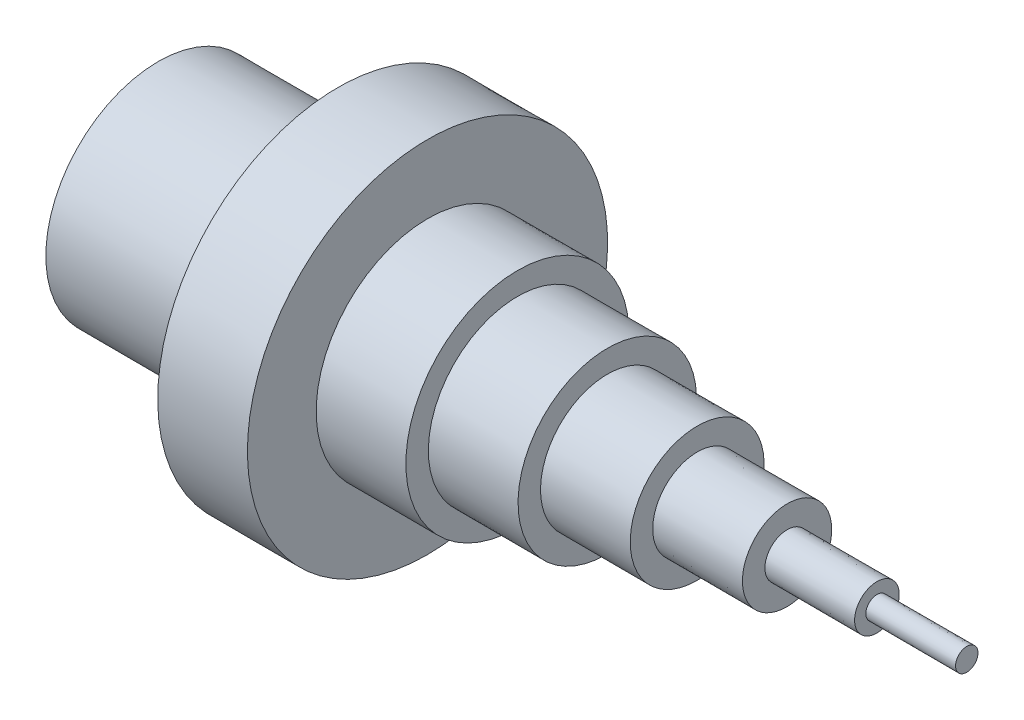
ISO-10303-21;
HEADER;
FILE_DESCRIPTION(('STEP AP214'),'2;1');
FILE_NAME('part.step','',(''),(''),'','','');
FILE_SCHEMA(('AUTOMOTIVE_DESIGN { 1 0 10303 214 1 1 1 1 }'));
ENDSEC;
DATA;
#1=APPLICATION_CONTEXT('core data for automotive mechanical design processes');
#2=APPLICATION_PROTOCOL_DEFINITION('international standard','automotive_design',2000,#1);
#3=PRODUCT_CONTEXT('',#1,'mechanical');
#4=PRODUCT('Part','Part','',(#3));
#5=PRODUCT_RELATED_PRODUCT_CATEGORY('part','',(#4));
#6=PRODUCT_DEFINITION_FORMATION('','',#4);
#7=PRODUCT_DEFINITION_CONTEXT('part definition',#1,'design');
#8=PRODUCT_DEFINITION('design','',#6,#7);
#9=PRODUCT_DEFINITION_SHAPE('','',#8);
#10=(LENGTH_UNIT() NAMED_UNIT(*) SI_UNIT(.MILLI.,.METRE.));
#11=(NAMED_UNIT(*) PLANE_ANGLE_UNIT() SI_UNIT($,.RADIAN.));
#12=(NAMED_UNIT(*) SI_UNIT($,.STERADIAN.) SOLID_ANGLE_UNIT());
#13=UNCERTAINTY_MEASURE_WITH_UNIT(LENGTH_MEASURE(1.E-05),#10,'distance_accuracy_value','');
#14=(GEOMETRIC_REPRESENTATION_CONTEXT(3) GLOBAL_UNCERTAINTY_ASSIGNED_CONTEXT((#13)) GLOBAL_UNIT_ASSIGNED_CONTEXT((#10,
#11,#12)) REPRESENTATION_CONTEXT('',''));
#15=CARTESIAN_POINT('',(0.,0.,0.));
#16=DIRECTION('',(0.,0.,1.));
#17=DIRECTION('',(1.,0.,0.));
#18=AXIS2_PLACEMENT_3D('',#15,#16,#17);
#19=CARTESIAN_POINT('',(-0.0389383587412806,6.06479783856779E-05,0.));
#20=DIRECTION('',(-0.999998787039697,0.00155753623888085,0.));
#21=DIRECTION('',(-0.00155753623888085,-0.999998787039697,0.));
#22=AXIS2_PLACEMENT_3D('',#19,#20,#21);
#23=CONICAL_SURFACE('',#22,24.9999696759924,1.56923878992627);
#24=CARTESIAN_POINT('',(0.,0.,0.));
#25=VERTEX_POINT('',#24);
#26=VERTEX_LOOP('',#25);
#27=FACE_BOUND('',#26,.T.);
#28=CARTESIAN_POINT('',(-0.0389383587412806,6.06479783856779E-05,0.));
#29=DIRECTION('',(-0.999998787039697,0.00155753623888085,0.));
#30=DIRECTION('',(-0.00155753623888085,-0.999998787039697,0.));
#31=AXIS2_PLACEMENT_3D('',#28,#29,#30);
#32=CIRCLE('',#31,24.9999696759924);
#33=CARTESIAN_POINT('',(-0.0778767174825613,-24.9998787040432,0.));
#34=VERTEX_POINT('',#33);
#35=EDGE_CURVE('E11',#34,#34,#32,.T.);
#36=ORIENTED_EDGE('',*,*,#35,.T.);
#37=EDGE_LOOP('',(#36));
#38=FACE_BOUND('',#37,.T.);
#39=ADVANCED_FACE('F33',(#27,#38),#23,.F.);
#40=CARTESIAN_POINT('',(39.9609646044933,-0.0622407260076633,0.));
#41=DIRECTION('',(0.999998787039697,-0.00155753623888085,0.));
#42=DIRECTION('',(0.00155753623888085,0.999998787039697,0.));
#43=AXIS2_PLACEMENT_3D('',#40,#41,#42);
#44=CONICAL_SURFACE('',#43,25.0622711255476,0.00155753686862428);
#45=ORIENTED_EDGE('',*,*,#35,.F.);
#46=EDGE_LOOP('',(#45));
#47=FACE_BOUND('',#46,.T.);
#48=CARTESIAN_POINT('',(39.9609646044933,-0.0622407260076633,0.));
#49=DIRECTION('',(-0.999998787039697,0.00155753623888085,0.));
#50=DIRECTION('',(-0.00155753623888085,-0.999998787039697,0.));
#51=AXIS2_PLACEMENT_3D('',#48,#49,#50);
#52=CIRCLE('',#51,25.0622711255476);
#53=CARTESIAN_POINT('',(39.9219292089866,-25.1244814520153,0.));
#54=VERTEX_POINT('',#53);
#55=EDGE_CURVE('E40',#54,#54,#52,.T.);
#56=ORIENTED_EDGE('',*,*,#55,.T.);
#57=EDGE_LOOP('',(#56));
#58=FACE_BOUND('',#57,.T.);
#59=ADVANCED_FACE('F59',(#47,#58),#44,.T.);
#60=CARTESIAN_POINT('',(39.9376015892485,-0.0622043372206319,0.));
#61=DIRECTION('',(-0.999998787039697,0.00155753623888085,0.));
#62=DIRECTION('',(-0.00155753623888085,-0.999998787039697,0.));
#63=AXIS2_PLACEMENT_3D('',#60,#61,#62);
#64=CONICAL_SURFACE('',#63,40.0622529311431,1.56923878992627);
#65=ORIENTED_EDGE('',*,*,#55,.F.);
#66=EDGE_LOOP('',(#65));
#67=FACE_BOUND('',#66,.T.);
#68=CARTESIAN_POINT('',(39.9376015892485,-0.0622043372206319,0.));
#69=DIRECTION('',(-0.999998787039697,0.00155753623888085,0.));
#70=DIRECTION('',(-0.00155753623888085,-0.999998787039697,0.));
#71=AXIS2_PLACEMENT_3D('',#68,#69,#70);
#72=CIRCLE('',#71,40.0622529311431);
#73=CARTESIAN_POINT('',(39.8752031784971,-40.1244086744413,0.));
#74=VERTEX_POINT('',#73);
#75=EDGE_CURVE('E71',#74,#74,#72,.T.);
#76=ORIENTED_EDGE('',*,*,#75,.T.);
#77=EDGE_LOOP('',(#76));
#78=FACE_BOUND('',#77,.T.);
#79=ADVANCED_FACE('F63',(#67,#78),#64,.F.);
#80=CARTESIAN_POINT('',(59.9375530708658,-0.0933550242136564,0.));
#81=DIRECTION('',(0.999998787039697,-0.00155753623888085,0.));
#82=DIRECTION('',(0.00155753623888085,0.999998787039697,0.));
#83=AXIS2_PLACEMENT_3D('',#80,#81,#82);
#84=CONICAL_SURFACE('',#83,40.0934036559207,0.00155753686862454);
#85=ORIENTED_EDGE('',*,*,#75,.F.);
#86=EDGE_LOOP('',(#85));
#87=FACE_BOUND('',#86,.T.);
#88=CARTESIAN_POINT('',(59.9375530708658,-0.0933550242136564,0.));
#89=DIRECTION('',(-0.999998787039697,0.00155753623888085,0.));
#90=DIRECTION('',(-0.00155753623888085,-0.999998787039697,0.));
#91=AXIS2_PLACEMENT_3D('',#88,#89,#90);
#92=CIRCLE('',#91,40.0934036559207);
#93=CARTESIAN_POINT('',(59.8751061417317,-40.1867100484273,0.));
#94=VERTEX_POINT('',#93);
#95=EDGE_CURVE('E73',#94,#94,#92,.T.);
#96=ORIENTED_EDGE('',*,*,#95,.T.);
#97=EDGE_LOOP('',(#96));
#98=FACE_BOUND('',#97,.T.);
#99=ADVANCED_FACE('F162',(#87,#98),#84,.T.);
#100=CARTESIAN_POINT('',(59.9613527510402,-0.0933920931229649,0.));
#101=DIRECTION('',(-0.999998787039697,0.00155753623888085,0.));
#102=DIRECTION('',(-0.00155753623888085,-0.999998787039697,0.));
#103=AXIS2_PLACEMENT_3D('',#100,#101,#102);
#104=CONICAL_SURFACE('',#103,24.8130656578542,1.56923878992627);
#105=ORIENTED_EDGE('',*,*,#95,.F.);
#106=EDGE_LOOP('',(#105));
#107=FACE_BOUND('',#106,.T.);
#108=CARTESIAN_POINT('',(59.9613527510402,-0.0933920931229649,0.));
#109=DIRECTION('',(-0.999998787039697,0.00155753623888085,0.));
#110=DIRECTION('',(-0.00155753623888085,-0.999998787039697,0.));
#111=AXIS2_PLACEMENT_3D('',#108,#109,#110);
#112=CIRCLE('',#111,24.8130656578542);
#113=CARTESIAN_POINT('',(59.9227055020803,-24.9064276537135,0.));
#114=VERTEX_POINT('',#113);
#115=EDGE_CURVE('E78',#114,#114,#112,.T.);
#116=ORIENTED_EDGE('',*,*,#115,.T.);
#117=EDGE_LOOP('',(#116));
#118=FACE_BOUND('',#117,.T.);
#119=ADVANCED_FACE('F158',(#107,#118),#104,.T.);
#120=CARTESIAN_POINT('',(79.9613042326574,-0.124542780115989,0.));
#121=DIRECTION('',(0.999998787039697,-0.00155753623888085,0.));
#122=DIRECTION('',(0.00155753623888085,0.999998787039697,0.));
#123=AXIS2_PLACEMENT_3D('',#120,#121,#122);
#124=CONICAL_SURFACE('',#123,24.8442163826318,0.00155753686862454);
#125=ORIENTED_EDGE('',*,*,#115,.F.);
#126=EDGE_LOOP('',(#125));
#127=FACE_BOUND('',#126,.T.);
#128=CARTESIAN_POINT('',(79.9613042326574,-0.124542780115989,0.));
#129=DIRECTION('',(-0.999998787039697,0.00155753623888085,0.));
#130=DIRECTION('',(-0.00155753623888085,-0.999998787039697,0.));
#131=AXIS2_PLACEMENT_3D('',#128,#129,#130);
#132=CIRCLE('',#131,24.8442163826318);
#133=CARTESIAN_POINT('',(79.9226084653149,-24.9687290276996,0.));
#134=VERTEX_POINT('',#133);
#135=EDGE_CURVE('E81',#134,#134,#132,.T.);
#136=ORIENTED_EDGE('',*,*,#135,.T.);
#137=EDGE_LOOP('',(#136));
#138=FACE_BOUND('',#137,.T.);
#139=ADVANCED_FACE('F154',(#127,#138),#124,.T.);
#140=CARTESIAN_POINT('',(79.9690919044057,-0.124554909711666,0.));
#141=DIRECTION('',(-0.999998787039697,0.00155753623888085,0.));
#142=DIRECTION('',(-0.00155753623888085,-0.999998787039697,0.));
#143=AXIS2_PLACEMENT_3D('',#140,#141,#142);
#144=CONICAL_SURFACE('',#143,19.8442224474333,1.56923878992627);
#145=ORIENTED_EDGE('',*,*,#135,.F.);
#146=EDGE_LOOP('',(#145));
#147=FACE_BOUND('',#146,.T.);
#148=CARTESIAN_POINT('',(79.9690919044057,-0.124554909711666,0.));
#149=DIRECTION('',(-0.999998787039697,0.00155753623888085,0.));
#150=DIRECTION('',(-0.00155753623888085,-0.999998787039697,0.));
#151=AXIS2_PLACEMENT_3D('',#148,#149,#150);
#152=CIRCLE('',#151,19.8442224474334);
#153=CARTESIAN_POINT('',(79.9381838088114,-19.9687532868909,0.));
#154=VERTEX_POINT('',#153);
#155=EDGE_CURVE('E84',#154,#154,#152,.T.);
#156=ORIENTED_EDGE('',*,*,#155,.T.);
#157=EDGE_LOOP('',(#156));
#158=FACE_BOUND('',#157,.T.);
#159=ADVANCED_FACE('F150',(#147,#158),#144,.T.);
#160=CARTESIAN_POINT('',(99.969043386023,-0.155705596704691,0.));
#161=DIRECTION('',(0.999998787039697,-0.00155753623888085,0.));
#162=DIRECTION('',(0.00155753623888085,0.999998787039697,0.));
#163=AXIS2_PLACEMENT_3D('',#160,#161,#162);
#164=CONICAL_SURFACE('',#163,19.875373172211,0.00155753686862454);
#165=ORIENTED_EDGE('',*,*,#155,.F.);
#166=EDGE_LOOP('',(#165));
#167=FACE_BOUND('',#166,.T.);
#168=CARTESIAN_POINT('',(99.969043386023,-0.155705596704691,0.));
#169=DIRECTION('',(-0.999998787039697,0.00155753623888085,0.));
#170=DIRECTION('',(-0.00155753623888085,-0.999998787039697,0.));
#171=AXIS2_PLACEMENT_3D('',#168,#169,#170);
#172=CIRCLE('',#171,19.875373172211);
#173=CARTESIAN_POINT('',(99.938086772046,-20.031054660877,0.));
#174=VERTEX_POINT('',#173);
#175=EDGE_CURVE('E87',#174,#174,#172,.T.);
#176=ORIENTED_EDGE('',*,*,#175,.T.);
#177=EDGE_LOOP('',(#176));
#178=FACE_BOUND('',#177,.T.);
#179=ADVANCED_FACE('F146',(#167,#178),#164,.T.);
#180=CARTESIAN_POINT('',(99.9768310577713,-0.155717726300368,0.));
#181=DIRECTION('',(-0.999998787039697,0.00155753623888085,0.));
#182=DIRECTION('',(-0.00155753623888085,-0.999998787039697,0.));
#183=AXIS2_PLACEMENT_3D('',#180,#181,#182);
#184=CONICAL_SURFACE('',#183,14.8753792370125,1.56923878992627);
#185=ORIENTED_EDGE('',*,*,#175,.F.);
#186=EDGE_LOOP('',(#185));
#187=FACE_BOUND('',#186,.T.);
#188=CARTESIAN_POINT('',(99.9768310577713,-0.155717726300368,0.));
#189=DIRECTION('',(-0.999998787039697,0.00155753623888085,0.));
#190=DIRECTION('',(-0.00155753623888085,-0.999998787039697,0.));
#191=AXIS2_PLACEMENT_3D('',#188,#189,#190);
#192=CIRCLE('',#191,14.8753792370125);
#193=CARTESIAN_POINT('',(99.9536621155425,-15.0310789200683,0.));
#194=VERTEX_POINT('',#193);
#195=EDGE_CURVE('E90',#194,#194,#192,.T.);
#196=ORIENTED_EDGE('',*,*,#195,.T.);
#197=EDGE_LOOP('',(#196));
#198=FACE_BOUND('',#197,.T.);
#199=ADVANCED_FACE('F142',(#187,#198),#184,.T.);
#200=CARTESIAN_POINT('',(119.976782539389,-0.186868413293393,0.));
#201=DIRECTION('',(0.999998787039697,-0.00155753623888085,0.));
#202=DIRECTION('',(0.00155753623888085,0.999998787039697,0.));
#203=AXIS2_PLACEMENT_3D('',#200,#201,#202);
#204=CONICAL_SURFACE('',#203,14.9065299617901,0.00155753686862436);
#205=ORIENTED_EDGE('',*,*,#195,.F.);
#206=EDGE_LOOP('',(#205));
#207=FACE_BOUND('',#206,.T.);
#208=CARTESIAN_POINT('',(119.976782539389,-0.186868413293393,0.));
#209=DIRECTION('',(-0.999998787039697,0.00155753623888085,0.));
#210=DIRECTION('',(-0.00155753623888085,-0.999998787039697,0.));
#211=AXIS2_PLACEMENT_3D('',#208,#209,#210);
#212=CIRCLE('',#211,14.9065299617901);
#213=CARTESIAN_POINT('',(119.953565078777,-15.0933802940544,0.));
#214=VERTEX_POINT('',#213);
#215=EDGE_CURVE('E93',#214,#214,#212,.T.);
#216=ORIENTED_EDGE('',*,*,#215,.T.);
#217=EDGE_LOOP('',(#216));
#218=FACE_BOUND('',#217,.T.);
#219=ADVANCED_FACE('F138',(#207,#218),#204,.T.);
#220=CARTESIAN_POINT('',(119.984570211137,-0.18688054288907,0.));
#221=DIRECTION('',(-0.999998787039697,0.00155753623888085,0.));
#222=DIRECTION('',(-0.00155753623888085,-0.999998787039697,0.));
#223=AXIS2_PLACEMENT_3D('',#220,#221,#222);
#224=CONICAL_SURFACE('',#223,9.90653602659162,1.56923878992627);
#225=ORIENTED_EDGE('',*,*,#215,.F.);
#226=EDGE_LOOP('',(#225));
#227=FACE_BOUND('',#226,.T.);
#228=CARTESIAN_POINT('',(119.984570211137,-0.18688054288907,0.));
#229=DIRECTION('',(-0.999998787039697,0.00155753623888085,0.));
#230=DIRECTION('',(-0.00155753623888085,-0.999998787039697,0.));
#231=AXIS2_PLACEMENT_3D('',#228,#229,#230);
#232=CIRCLE('',#231,9.90653602659162);
#233=CARTESIAN_POINT('',(119.969140422274,-10.0934045532457,0.));
#234=VERTEX_POINT('',#233);
#235=EDGE_CURVE('E96',#234,#234,#232,.T.);
#236=ORIENTED_EDGE('',*,*,#235,.T.);
#237=EDGE_LOOP('',(#236));
#238=FACE_BOUND('',#237,.T.);
#239=ADVANCED_FACE('F134',(#227,#238),#224,.T.);
#240=CARTESIAN_POINT('',(139.984521692754,-0.218031229882094,0.));
#241=DIRECTION('',(0.999998787039697,-0.00155753623888085,0.));
#242=DIRECTION('',(0.00155753623888085,0.999998787039697,0.));
#243=AXIS2_PLACEMENT_3D('',#240,#241,#242);
#244=CONICAL_SURFACE('',#243,9.93768675136923,0.00155753686862436);
#245=ORIENTED_EDGE('',*,*,#235,.F.);
#246=EDGE_LOOP('',(#245));
#247=FACE_BOUND('',#246,.T.);
#248=CARTESIAN_POINT('',(139.984521692754,-0.218031229882094,0.));
#249=DIRECTION('',(-0.999998787039697,0.00155753623888085,0.));
#250=DIRECTION('',(-0.00155753623888085,-0.999998787039697,0.));
#251=AXIS2_PLACEMENT_3D('',#248,#249,#250);
#252=CIRCLE('',#251,9.93768675136923);
#253=CARTESIAN_POINT('',(139.969043385508,-10.1557059272318,0.));
#254=VERTEX_POINT('',#253);
#255=EDGE_CURVE('E99',#254,#254,#252,.T.);
#256=ORIENTED_EDGE('',*,*,#255,.T.);
#257=EDGE_LOOP('',(#256));
#258=FACE_BOUND('',#257,.T.);
#259=ADVANCED_FACE('F130',(#247,#258),#244,.T.);
#260=CARTESIAN_POINT('',(139.992309364502,-0.218043359477771,0.));
#261=DIRECTION('',(-0.999998787039697,0.00155753623888085,0.));
#262=DIRECTION('',(-0.00155753623888085,-0.999998787039697,0.));
#263=AXIS2_PLACEMENT_3D('',#260,#261,#262);
#264=CONICAL_SURFACE('',#263,4.93769281617075,1.56923878992627);
#265=ORIENTED_EDGE('',*,*,#255,.F.);
#266=EDGE_LOOP('',(#265));
#267=FACE_BOUND('',#266,.T.);
#268=CARTESIAN_POINT('',(139.992309364502,-0.218043359477771,0.));
#269=DIRECTION('',(-0.999998787039697,0.00155753623888085,0.));
#270=DIRECTION('',(-0.00155753623888085,-0.999998787039697,0.));
#271=AXIS2_PLACEMENT_3D('',#268,#269,#270);
#272=CIRCLE('',#271,4.93769281617075);
#273=CARTESIAN_POINT('',(139.984618729005,-5.15573018642315,0.));
#274=VERTEX_POINT('',#273);
#275=EDGE_CURVE('E102',#274,#274,#272,.T.);
#276=ORIENTED_EDGE('',*,*,#275,.T.);
#277=EDGE_LOOP('',(#276));
#278=FACE_BOUND('',#277,.T.);
#279=ADVANCED_FACE('F123',(#267,#278),#264,.T.);
#280=CARTESIAN_POINT('',(159.99226084612,-0.249194046470796,0.));
#281=DIRECTION('',(0.999998787039697,-0.00155753623888085,0.));
#282=DIRECTION('',(0.00155753623888085,0.999998787039697,0.));
#283=AXIS2_PLACEMENT_3D('',#280,#281,#282);
#284=CONICAL_SURFACE('',#283,4.96884354094837,0.00155753686862432);
#285=ORIENTED_EDGE('',*,*,#275,.F.);
#286=EDGE_LOOP('',(#285));
#287=FACE_BOUND('',#286,.T.);
#288=CARTESIAN_POINT('',(159.99226084612,-0.249194046470796,0.));
#289=DIRECTION('',(-0.999998787039697,0.00155753623888085,0.));
#290=DIRECTION('',(-0.00155753623888085,-0.999998787039697,0.));
#291=AXIS2_PLACEMENT_3D('',#288,#289,#290);
#292=CIRCLE('',#291,4.96884354094837);
#293=CARTESIAN_POINT('',(159.984521692239,-5.2180315604092,0.));
#294=VERTEX_POINT('',#293);
#295=EDGE_CURVE('E105',#294,#294,#292,.T.);
#296=ORIENTED_EDGE('',*,*,#295,.T.);
#297=EDGE_LOOP('',(#296));
#298=FACE_BOUND('',#297,.T.);
#299=ADVANCED_FACE('F117',(#287,#298),#284,.T.);
#300=CARTESIAN_POINT('',(159.996154681994,-0.249200111268634,0.));
#301=DIRECTION('',(-0.999998787039697,0.00155753623888085,0.));
#302=DIRECTION('',(-0.00155753623888085,-0.999998787039697,0.));
#303=AXIS2_PLACEMENT_3D('',#300,#301,#302);
#304=CONICAL_SURFACE('',#303,2.46884657334912,1.56923878992627);
#305=ORIENTED_EDGE('',*,*,#295,.F.);
#306=EDGE_LOOP('',(#305));
#307=FACE_BOUND('',#306,.T.);
#308=CARTESIAN_POINT('',(159.996154681994,-0.249200111268634,0.));
#309=DIRECTION('',(-0.999998787039697,0.00155753623888085,0.));
#310=DIRECTION('',(-0.00155753623888085,-0.999998787039697,0.));
#311=AXIS2_PLACEMENT_3D('',#308,#309,#310);
#312=CIRCLE('',#311,2.46884657334912);
#313=CARTESIAN_POINT('',(159.992309363988,-2.71804369000487,0.));
#314=VERTEX_POINT('',#313);
#315=EDGE_CURVE('E108',#314,#314,#312,.T.);
#316=ORIENTED_EDGE('',*,*,#315,.T.);
#317=EDGE_LOOP('',(#316));
#318=FACE_BOUND('',#317,.T.);
#319=ADVANCED_FACE('F54',(#307,#318),#304,.T.);
#320=CARTESIAN_POINT('',(179.996106163611,-0.280350798261659,0.));
#321=DIRECTION('',(0.999998787039697,-0.00155753623888085,0.));
#322=DIRECTION('',(0.00155753623888085,0.999998787039697,0.));
#323=AXIS2_PLACEMENT_3D('',#320,#321,#322);
#324=CONICAL_SURFACE('',#323,2.49999729812674,0.00155753686862437);
#325=ORIENTED_EDGE('',*,*,#315,.F.);
#326=EDGE_LOOP('',(#325));
#327=FACE_BOUND('',#326,.T.);
#328=CARTESIAN_POINT('',(179.996106163611,-0.280350798261659,0.));
#329=DIRECTION('',(-0.999998787039697,0.00155753623888085,0.));
#330=DIRECTION('',(-0.00155753623888085,-0.999998787039697,0.));
#331=AXIS2_PLACEMENT_3D('',#328,#329,#330);
#332=CIRCLE('',#331,2.49999729812674);
#333=CARTESIAN_POINT('',(179.992212327222,-2.78034506399092,0.));
#334=VERTEX_POINT('',#333);
#335=EDGE_CURVE('E111',#334,#334,#332,.T.);
#336=ORIENTED_EDGE('',*,*,#335,.T.);
#337=EDGE_LOOP('',(#336));
#338=FACE_BOUND('',#337,.T.);
#339=ADVANCED_FACE('F48',(#327,#338),#324,.T.);
#340=CARTESIAN_POINT('',(179.999781667145,-0.280356522998554,0.));
#341=DIRECTION('',(-0.999998787039697,0.00155753623888085,0.));
#342=DIRECTION('',(-0.00155753623888085,-0.999998787039697,0.));
#343=AXIS2_PLACEMENT_3D('',#340,#341,#342);
#344=CONICAL_SURFACE('',#343,0.,1.56932612306821);
#345=ORIENTED_EDGE('',*,*,#335,.F.);
#346=EDGE_LOOP('',(#345));
#347=FACE_BOUND('',#346,.T.);
#348=CARTESIAN_POINT('',(179.999781667145,-0.280356522998554,0.));
#349=VERTEX_POINT('',#348);
#350=VERTEX_LOOP('',#349);
#351=FACE_BOUND('',#350,.T.);
#352=ADVANCED_FACE('F46',(#347,#351),#344,.T.);
#353=CLOSED_SHELL('',(#39,#59,#79,#99,#119,#139,#159,#179,#199,#219,#239,#259,#279,#299,#319,
#339,#352));
#354=MANIFOLD_SOLID_BREP('B2',#353);
#355=ADVANCED_BREP_SHAPE_REPRESENTATION('',(#18,#354),#14);
#356=SHAPE_DEFINITION_REPRESENTATION(#9,#355);
ENDSEC;
END-ISO-10303-21;
